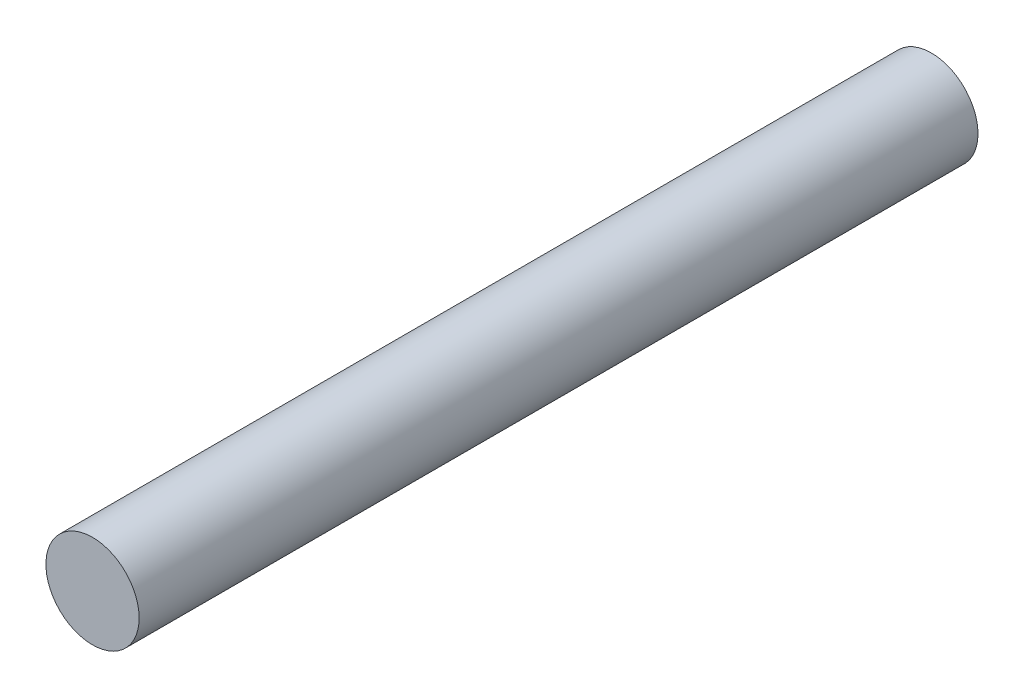
ISO-10303-21;
HEADER;
FILE_DESCRIPTION(('STEP AP214'),'2;1');
FILE_NAME('part.step','',(''),(''),'','','');
FILE_SCHEMA(('AUTOMOTIVE_DESIGN { 1 0 10303 214 1 1 1 1 }'));
ENDSEC;
DATA;
#1=APPLICATION_CONTEXT('core data for automotive mechanical design processes');
#2=APPLICATION_PROTOCOL_DEFINITION('international standard','automotive_design',2000,#1);
#3=PRODUCT_CONTEXT('',#1,'mechanical');
#4=PRODUCT('Part','Part','',(#3));
#5=PRODUCT_RELATED_PRODUCT_CATEGORY('part','',(#4));
#6=PRODUCT_DEFINITION_FORMATION('','',#4);
#7=PRODUCT_DEFINITION_CONTEXT('part definition',#1,'design');
#8=PRODUCT_DEFINITION('design','',#6,#7);
#9=PRODUCT_DEFINITION_SHAPE('','',#8);
#10=(LENGTH_UNIT() NAMED_UNIT(*) SI_UNIT(.MILLI.,.METRE.));
#11=(NAMED_UNIT(*) PLANE_ANGLE_UNIT() SI_UNIT($,.RADIAN.));
#12=(NAMED_UNIT(*) SI_UNIT($,.STERADIAN.) SOLID_ANGLE_UNIT());
#13=UNCERTAINTY_MEASURE_WITH_UNIT(LENGTH_MEASURE(1.E-05),#10,'distance_accuracy_value','');
#14=(GEOMETRIC_REPRESENTATION_CONTEXT(3) GLOBAL_UNCERTAINTY_ASSIGNED_CONTEXT((#13)) GLOBAL_UNIT_ASSIGNED_CONTEXT((#10,
#11,#12)) REPRESENTATION_CONTEXT('',''));
#15=CARTESIAN_POINT('',(0.,0.,0.));
#16=DIRECTION('',(0.,0.,1.));
#17=DIRECTION('',(1.,0.,0.));
#18=AXIS2_PLACEMENT_3D('',#15,#16,#17);
#19=CARTESIAN_POINT('',(0.,0.,57.15));
#20=DIRECTION('',(0.,0.,-1.));
#21=DIRECTION('',(-1.,0.,0.));
#22=AXIS2_PLACEMENT_3D('',#19,#20,#21);
#23=CYLINDRICAL_SURFACE('',#22,3.175);
#24=CARTESIAN_POINT('',(0.,0.,57.15));
#25=DIRECTION('',(0.,0.,1.));
#26=DIRECTION('',(1.,0.,0.));
#27=AXIS2_PLACEMENT_3D('',#24,#25,#26);
#28=CIRCLE('',#27,3.175);
#29=CARTESIAN_POINT('',(3.175,0.,57.15));
#30=VERTEX_POINT('',#29);
#31=EDGE_CURVE('E10',#30,#30,#28,.T.);
#32=ORIENTED_EDGE('',*,*,#31,.F.);
#33=EDGE_LOOP('',(#32));
#34=FACE_BOUND('',#33,.T.);
#35=CARTESIAN_POINT('',(0.,0.,0.));
#36=DIRECTION('',(0.,0.,1.));
#37=DIRECTION('',(1.,0.,0.));
#38=AXIS2_PLACEMENT_3D('',#35,#36,#37);
#39=CIRCLE('',#38,3.175);
#40=CARTESIAN_POINT('',(3.175,0.,0.));
#41=VERTEX_POINT('',#40);
#42=EDGE_CURVE('E34',#41,#41,#39,.T.);
#43=ORIENTED_EDGE('',*,*,#42,.T.);
#44=EDGE_LOOP('',(#43));
#45=FACE_BOUND('',#44,.T.);
#46=ADVANCED_FACE('F31',(#34,#45),#23,.T.);
#47=CARTESIAN_POINT('',(0.,0.,57.15));
#48=DIRECTION('',(0.,0.,1.));
#49=DIRECTION('',(1.,0.,0.));
#50=AXIS2_PLACEMENT_3D('',#47,#48,#49);
#51=PLANE('',#50);
#52=ORIENTED_EDGE('',*,*,#31,.T.);
#53=EDGE_LOOP('',(#52));
#54=FACE_BOUND('',#53,.T.);
#55=ADVANCED_FACE('F46',(#54),#51,.T.);
#56=CARTESIAN_POINT('',(0.,0.,0.));
#57=DIRECTION('',(0.,0.,1.));
#58=DIRECTION('',(1.,0.,0.));
#59=AXIS2_PLACEMENT_3D('',#56,#57,#58);
#60=PLANE('',#59);
#61=ORIENTED_EDGE('',*,*,#42,.F.);
#62=EDGE_LOOP('',(#61));
#63=FACE_BOUND('',#62,.T.);
#64=ADVANCED_FACE('F44',(#63),#60,.F.);
#65=CLOSED_SHELL('',(#46,#55,#64));
#66=MANIFOLD_SOLID_BREP('B2',#65);
#67=ADVANCED_BREP_SHAPE_REPRESENTATION('',(#18,#66),#14);
#68=SHAPE_DEFINITION_REPRESENTATION(#9,#67);
ENDSEC;
END-ISO-10303-21;
